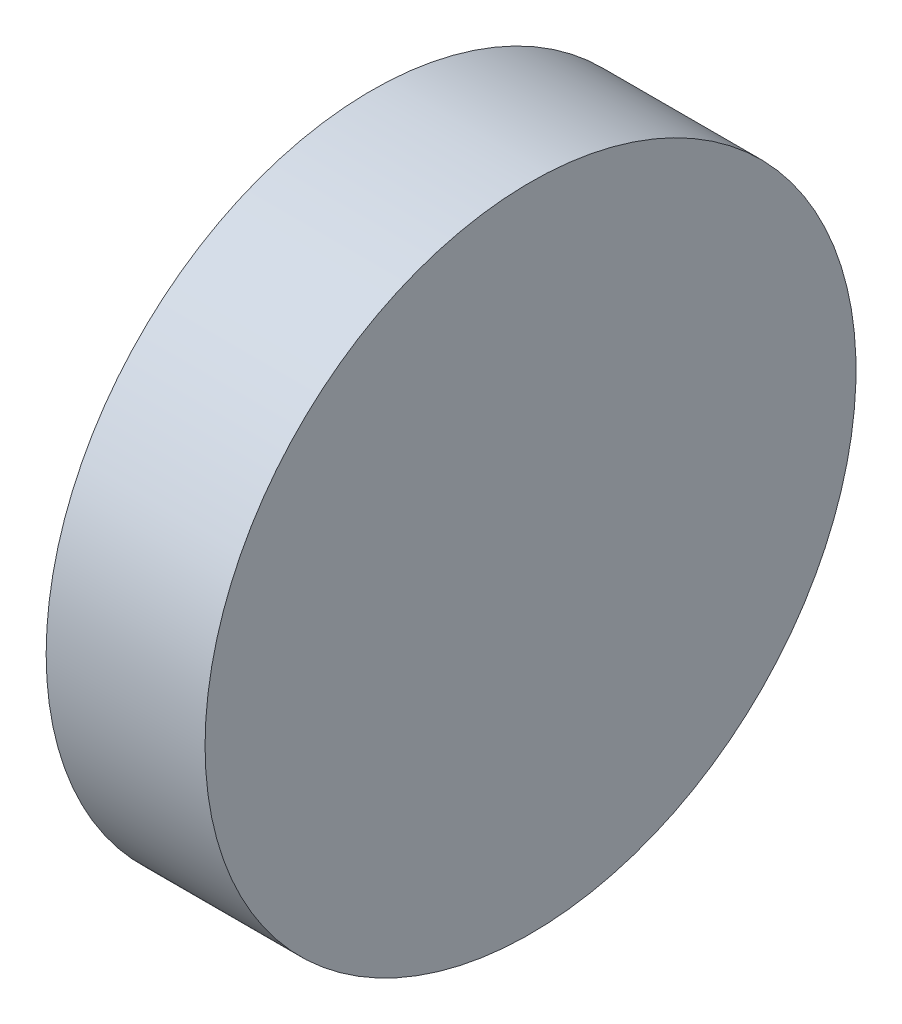
ISO-10303-21;
HEADER;
FILE_DESCRIPTION(('STEP AP214'),'2;1');
FILE_NAME('part.step','',(''),(''),'','','');
FILE_SCHEMA(('AUTOMOTIVE_DESIGN { 1 0 10303 214 1 1 1 1 }'));
ENDSEC;
DATA;
#1=APPLICATION_CONTEXT('core data for automotive mechanical design processes');
#2=APPLICATION_PROTOCOL_DEFINITION('international standard','automotive_design',2000,#1);
#3=PRODUCT_CONTEXT('',#1,'mechanical');
#4=PRODUCT('Part','Part','',(#3));
#5=PRODUCT_RELATED_PRODUCT_CATEGORY('part','',(#4));
#6=PRODUCT_DEFINITION_FORMATION('','',#4);
#7=PRODUCT_DEFINITION_CONTEXT('part definition',#1,'design');
#8=PRODUCT_DEFINITION('design','',#6,#7);
#9=PRODUCT_DEFINITION_SHAPE('','',#8);
#10=(LENGTH_UNIT() NAMED_UNIT(*) SI_UNIT(.MILLI.,.METRE.));
#11=(NAMED_UNIT(*) PLANE_ANGLE_UNIT() SI_UNIT($,.RADIAN.));
#12=(NAMED_UNIT(*) SI_UNIT($,.STERADIAN.) SOLID_ANGLE_UNIT());
#13=UNCERTAINTY_MEASURE_WITH_UNIT(LENGTH_MEASURE(1.E-05),#10,'distance_accuracy_value','');
#14=(GEOMETRIC_REPRESENTATION_CONTEXT(3) GLOBAL_UNCERTAINTY_ASSIGNED_CONTEXT((#13)) GLOBAL_UNIT_ASSIGNED_CONTEXT((#10,
#11,#12)) REPRESENTATION_CONTEXT('',''));
#15=CARTESIAN_POINT('',(0.,0.,0.));
#16=DIRECTION('',(0.,0.,1.));
#17=DIRECTION('',(1.,0.,0.));
#18=AXIS2_PLACEMENT_3D('',#15,#16,#17);
#19=CARTESIAN_POINT('',(262.824352893064,83.6431793490154,0.));
#20=DIRECTION('',(-1.,0.,0.));
#21=DIRECTION('',(0.,0.,1.));
#22=AXIS2_PLACEMENT_3D('',#19,#20,#21);
#23=PLANE('',#22);
#24=CARTESIAN_POINT('',(262.824352893064,83.6431793490154,0.));
#25=DIRECTION('',(-1.,0.,0.));
#26=DIRECTION('',(0.,0.,1.));
#27=AXIS2_PLACEMENT_3D('',#24,#25,#26);
#28=CIRCLE('',#27,6.34999999999999);
#29=CARTESIAN_POINT('',(262.824352893064,83.6431793490154,6.34999999999999));
#30=VERTEX_POINT('',#29);
#31=EDGE_CURVE('E10',#30,#30,#28,.T.);
#32=ORIENTED_EDGE('',*,*,#31,.F.);
#33=EDGE_LOOP('',(#32));
#34=FACE_BOUND('',#33,.T.);
#35=ADVANCED_FACE('F35',(#34),#23,.F.);
#36=CARTESIAN_POINT('',(254.000801992616,83.6431793490154,0.));
#37=DIRECTION('',(-1.,0.,0.));
#38=DIRECTION('',(0.,0.,1.));
#39=AXIS2_PLACEMENT_3D('',#36,#37,#38);
#40=CYLINDRICAL_SURFACE('',#39,6.34999999999999);
#41=CARTESIAN_POINT('',(259.724352893064,83.6431793490154,0.));
#42=DIRECTION('',(-1.,0.,0.));
#43=DIRECTION('',(0.,0.,1.));
#44=AXIS2_PLACEMENT_3D('',#41,#42,#43);
#45=CIRCLE('',#44,6.34999999999999);
#46=CARTESIAN_POINT('',(259.724352893064,83.6431793490154,6.34999999999999));
#47=VERTEX_POINT('',#46);
#48=EDGE_CURVE('E41',#47,#47,#45,.T.);
#49=ORIENTED_EDGE('',*,*,#48,.F.);
#50=EDGE_LOOP('',(#49));
#51=FACE_BOUND('',#50,.T.);
#52=ORIENTED_EDGE('',*,*,#31,.T.);
#53=EDGE_LOOP('',(#52));
#54=FACE_BOUND('',#53,.T.);
#55=ADVANCED_FACE('F49',(#51,#54),#40,.T.);
#56=CARTESIAN_POINT('',(259.724352893064,83.6431793490154,0.));
#57=DIRECTION('',(1.,0.,0.));
#58=DIRECTION('',(0.,0.,-1.));
#59=AXIS2_PLACEMENT_3D('',#56,#57,#58);
#60=PLANE('',#59);
#61=ORIENTED_EDGE('',*,*,#48,.T.);
#62=EDGE_LOOP('',(#61));
#63=FACE_BOUND('',#62,.T.);
#64=ADVANCED_FACE('F47',(#63),#60,.F.);
#65=CLOSED_SHELL('',(#35,#55,#64));
#66=MANIFOLD_SOLID_BREP('B2',#65);
#67=ADVANCED_BREP_SHAPE_REPRESENTATION('',(#18,#66),#14);
#68=SHAPE_DEFINITION_REPRESENTATION(#9,#67);
ENDSEC;
END-ISO-10303-21;
